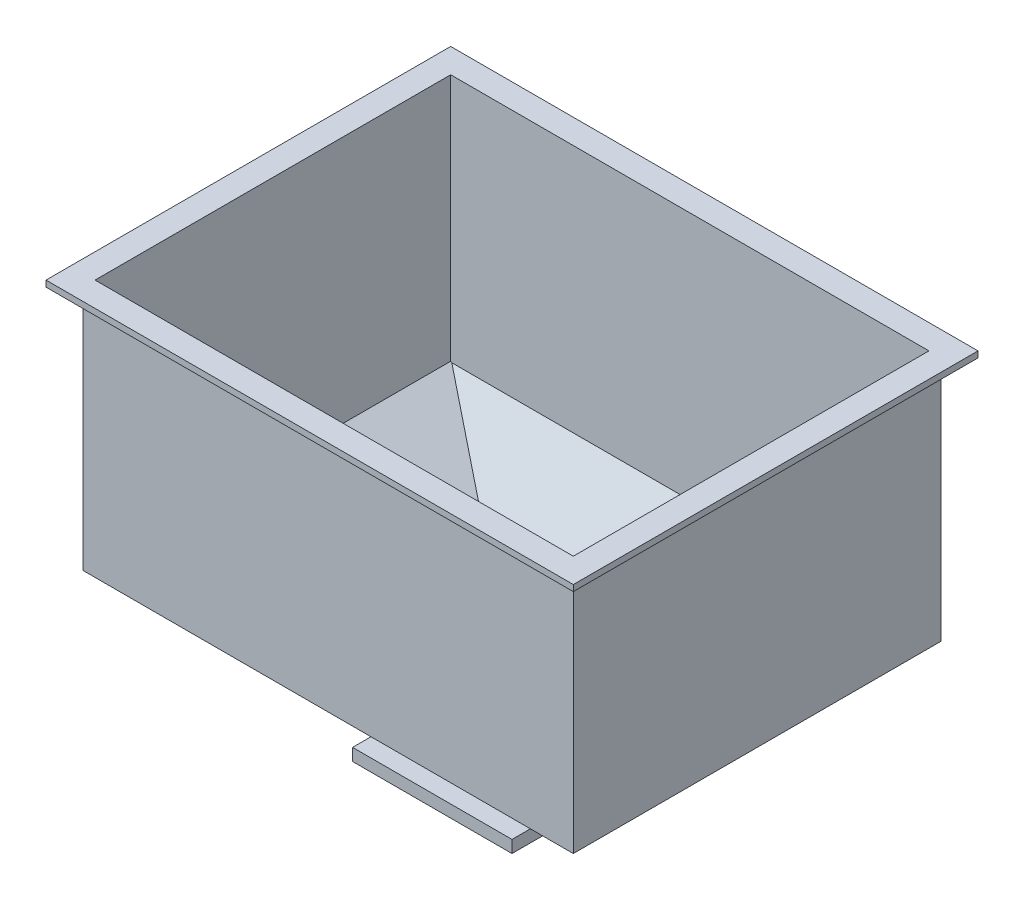
ISO-10303-21;
HEADER;
FILE_DESCRIPTION(('STEP AP214'),'2;1');
FILE_NAME('part.step','',(''),(''),'','','');
FILE_SCHEMA(('AUTOMOTIVE_DESIGN { 1 0 10303 214 1 1 1 1 }'));
ENDSEC;
DATA;
#1=APPLICATION_CONTEXT('core data for automotive mechanical design processes');
#2=APPLICATION_PROTOCOL_DEFINITION('international standard','automotive_design',2000,#1);
#3=PRODUCT_CONTEXT('',#1,'mechanical');
#4=PRODUCT('Part','Part','',(#3));
#5=PRODUCT_RELATED_PRODUCT_CATEGORY('part','',(#4));
#6=PRODUCT_DEFINITION_FORMATION('','',#4);
#7=PRODUCT_DEFINITION_CONTEXT('part definition',#1,'design');
#8=PRODUCT_DEFINITION('design','',#6,#7);
#9=PRODUCT_DEFINITION_SHAPE('','',#8);
#10=(LENGTH_UNIT() NAMED_UNIT(*) SI_UNIT(.MILLI.,.METRE.));
#11=(NAMED_UNIT(*) PLANE_ANGLE_UNIT() SI_UNIT($,.RADIAN.));
#12=(NAMED_UNIT(*) SI_UNIT($,.STERADIAN.) SOLID_ANGLE_UNIT());
#13=UNCERTAINTY_MEASURE_WITH_UNIT(LENGTH_MEASURE(1.E-05),#10,'distance_accuracy_value','');
#14=(GEOMETRIC_REPRESENTATION_CONTEXT(3) GLOBAL_UNCERTAINTY_ASSIGNED_CONTEXT((#13)) GLOBAL_UNIT_ASSIGNED_CONTEXT((#10,
#11,#12)) REPRESENTATION_CONTEXT('',''));
#15=CARTESIAN_POINT('',(0.,0.,0.));
#16=DIRECTION('',(0.,0.,1.));
#17=DIRECTION('',(1.,0.,0.));
#18=AXIS2_PLACEMENT_3D('',#15,#16,#17);
#19=CARTESIAN_POINT('',(0.,105.,0.));
#20=DIRECTION('',(0.,1.,0.));
#21=DIRECTION('',(0.,0.,1.));
#22=AXIS2_PLACEMENT_3D('',#19,#20,#21);
#23=PLANE('',#22);
#24=DIRECTION('',(0.,0.,1.));
#25=VECTOR('',#24,1.);
#26=CARTESIAN_POINT('',(-215.,105.,-315.));
#27=LINE('',#26,#25);
#28=CARTESIAN_POINT('',(-215.,105.,-315.));
#29=VERTEX_POINT('',#28);
#30=CARTESIAN_POINT('',(-215.,105.,15.));
#31=VERTEX_POINT('',#30);
#32=EDGE_CURVE('E227',#29,#31,#27,.T.);
#33=ORIENTED_EDGE('',*,*,#32,.T.);
#34=DIRECTION('',(1.,0.,0.));
#35=VECTOR('',#34,1.);
#36=CARTESIAN_POINT('',(-215.,105.,15.));
#37=LINE('',#36,#35);
#38=CARTESIAN_POINT('',(215.,105.,15.));
#39=VERTEX_POINT('',#38);
#40=EDGE_CURVE('E230',#31,#39,#37,.T.);
#41=ORIENTED_EDGE('',*,*,#40,.T.);
#42=DIRECTION('',(0.,0.,-1.));
#43=VECTOR('',#42,1.);
#44=CARTESIAN_POINT('',(215.,105.,-315.));
#45=LINE('',#44,#43);
#46=CARTESIAN_POINT('',(215.,105.,-315.));
#47=VERTEX_POINT('',#46);
#48=EDGE_CURVE('E233',#39,#47,#45,.T.);
#49=ORIENTED_EDGE('',*,*,#48,.T.);
#50=DIRECTION('',(-1.,0.,0.));
#51=VECTOR('',#50,1.);
#52=CARTESIAN_POINT('',(-215.,105.,-315.));
#53=LINE('',#52,#51);
#54=EDGE_CURVE('E235',#47,#29,#53,.T.);
#55=ORIENTED_EDGE('',*,*,#54,.T.);
#56=EDGE_LOOP('',(#33,#41,#49,#55));
#57=FACE_BOUND('',#56,.T.);
#58=DIRECTION('',(1.,0.,0.));
#59=VECTOR('',#58,1.);
#60=CARTESIAN_POINT('',(0.,105.,-295.));
#61=LINE('',#60,#59);
#62=CARTESIAN_POINT('',(-195.,105.,-295.));
#63=VERTEX_POINT('',#62);
#64=CARTESIAN_POINT('',(195.,105.,-295.));
#65=VERTEX_POINT('',#64);
#66=EDGE_CURVE('E213',#63,#65,#61,.T.);
#67=ORIENTED_EDGE('',*,*,#66,.T.);
#68=DIRECTION('',(0.,0.,1.));
#69=VECTOR('',#68,1.);
#70=CARTESIAN_POINT('',(195.,105.,0.));
#71=LINE('',#70,#69);
#72=CARTESIAN_POINT('',(195.,105.,-5.));
#73=VERTEX_POINT('',#72);
#74=EDGE_CURVE('E219',#65,#73,#71,.T.);
#75=ORIENTED_EDGE('',*,*,#74,.T.);
#76=DIRECTION('',(1.,0.,0.));
#77=VECTOR('',#76,1.);
#78=CARTESIAN_POINT('',(0.,105.,-5.));
#79=LINE('',#78,#77);
#80=CARTESIAN_POINT('',(-195.,105.,-5.));
#81=VERTEX_POINT('',#80);
#82=EDGE_CURVE('E211',#81,#73,#79,.T.);
#83=ORIENTED_EDGE('',*,*,#82,.F.);
#84=DIRECTION('',(0.,0.,1.));
#85=VECTOR('',#84,1.);
#86=CARTESIAN_POINT('',(-195.,105.,0.));
#87=LINE('',#86,#85);
#88=EDGE_CURVE('E222',#63,#81,#87,.T.);
#89=ORIENTED_EDGE('',*,*,#88,.F.);
#90=EDGE_LOOP('',(#67,#75,#83,#89));
#91=FACE_BOUND('',#90,.T.);
#92=ADVANCED_FACE('F34',(#57,#91),#23,.T.);
#93=CARTESIAN_POINT('',(200.,0.,-300.));
#94=DIRECTION('',(-1.,0.,0.));
#95=DIRECTION('',(0.,0.,1.));
#96=AXIS2_PLACEMENT_3D('',#93,#94,#95);
#97=PLANE('',#96);
#98=DIRECTION('',(0.,-1.,0.));
#99=VECTOR('',#98,1.);
#100=CARTESIAN_POINT('',(200.,0.,0.));
#101=LINE('',#100,#99);
#102=CARTESIAN_POINT('',(200.,100.,0.));
#103=VERTEX_POINT('',#102);
#104=CARTESIAN_POINT('',(200.,-100.,0.));
#105=VERTEX_POINT('',#104);
#106=EDGE_CURVE('E327',#103,#105,#101,.T.);
#107=ORIENTED_EDGE('',*,*,#106,.T.);
#108=DIRECTION('',(0.,0.,1.));
#109=VECTOR('',#108,1.);
#110=CARTESIAN_POINT('',(200.,-100.,-300.));
#111=LINE('',#110,#109);
#112=CARTESIAN_POINT('',(200.,-100.,-300.));
#113=VERTEX_POINT('',#112);
#114=EDGE_CURVE('E11',#113,#105,#111,.T.);
#115=ORIENTED_EDGE('',*,*,#114,.F.);
#116=DIRECTION('',(0.,-1.,0.));
#117=VECTOR('',#116,1.);
#118=CARTESIAN_POINT('',(200.,0.,-300.));
#119=LINE('',#118,#117);
#120=CARTESIAN_POINT('',(200.,100.,-300.));
#121=VERTEX_POINT('',#120);
#122=EDGE_CURVE('E328',#121,#113,#119,.T.);
#123=ORIENTED_EDGE('',*,*,#122,.F.);
#124=DIRECTION('',(0.,0.,1.));
#125=VECTOR('',#124,1.);
#126=CARTESIAN_POINT('',(200.,100.,-300.));
#127=LINE('',#126,#125);
#128=EDGE_CURVE('E38',#121,#103,#127,.T.);
#129=ORIENTED_EDGE('',*,*,#128,.T.);
#130=EDGE_LOOP('',(#107,#115,#123,#129));
#131=FACE_BOUND('',#130,.T.);
#132=ADVANCED_FACE('F36',(#131),#97,.F.);
#133=CARTESIAN_POINT('',(107.692307692308,-161.538461538462,-300.));
#134=DIRECTION('',(0.554700196225229,-0.832050294337844,0.));
#135=DIRECTION('',(0.832050294337844,0.554700196225229,0.));
#136=AXIS2_PLACEMENT_3D('',#133,#134,#135);
#137=PLANE('',#136);
#138=DIRECTION('',(0.727606875108999,0.485071250072666,0.485071250072666));
#139=VECTOR('',#138,1.);
#140=CARTESIAN_POINT('',(23.5294117647059,-217.647058823529,-117.647058823529));
#141=LINE('',#140,#139);
#142=CARTESIAN_POINT('',(50.,-200.,-100.));
#143=VERTEX_POINT('',#142);
#144=EDGE_CURVE('E321',#143,#105,#141,.T.);
#145=ORIENTED_EDGE('',*,*,#144,.F.);
#146=DIRECTION('',(0.,0.,1.));
#147=VECTOR('',#146,1.);
#148=CARTESIAN_POINT('',(50.,-200.,-300.));
#149=LINE('',#148,#147);
#150=CARTESIAN_POINT('',(50.,-200.,-200.));
#151=VERTEX_POINT('',#150);
#152=EDGE_CURVE('E43',#151,#143,#149,.T.);
#153=ORIENTED_EDGE('',*,*,#152,.F.);
#154=DIRECTION('',(-0.727606875108999,-0.485071250072666,0.485071250072666));
#155=VECTOR('',#154,1.);
#156=CARTESIAN_POINT('',(129.411764705882,-147.058823529412,-252.941176470588));
#157=LINE('',#156,#155);
#158=EDGE_CURVE('E325',#113,#151,#157,.T.);
#159=ORIENTED_EDGE('',*,*,#158,.F.);
#160=ORIENTED_EDGE('',*,*,#114,.T.);
#161=EDGE_LOOP('',(#145,#153,#159,#160));
#162=FACE_BOUND('',#161,.T.);
#163=ADVANCED_FACE('F387',(#162),#137,.T.);
#164=CARTESIAN_POINT('',(-107.692307692308,-161.538461538462,-300.));
#165=DIRECTION('',(-0.554700196225229,-0.832050294337844,0.));
#166=DIRECTION('',(0.832050294337844,-0.554700196225229,0.));
#167=AXIS2_PLACEMENT_3D('',#164,#165,#166);
#168=PLANE('',#167);
#169=DIRECTION('',(0.727606875108999,-0.485071250072666,-0.485071250072666));
#170=VECTOR('',#169,1.);
#171=CARTESIAN_POINT('',(-23.5294117647059,-217.647058823529,-117.647058823529));
#172=LINE('',#171,#170);
#173=CARTESIAN_POINT('',(-200.,-100.,0.));
#174=VERTEX_POINT('',#173);
#175=CARTESIAN_POINT('',(-50.,-200.,-100.));
#176=VERTEX_POINT('',#175);
#177=EDGE_CURVE('E312',#174,#176,#172,.T.);
#178=ORIENTED_EDGE('',*,*,#177,.F.);
#179=DIRECTION('',(0.,0.,1.));
#180=VECTOR('',#179,1.);
#181=CARTESIAN_POINT('',(-200.,-100.,-300.));
#182=LINE('',#181,#180);
#183=CARTESIAN_POINT('',(-200.,-100.,-300.));
#184=VERTEX_POINT('',#183);
#185=EDGE_CURVE('E349',#184,#174,#182,.T.);
#186=ORIENTED_EDGE('',*,*,#185,.F.);
#187=DIRECTION('',(-0.727606875108999,0.485071250072666,-0.485071250072666));
#188=VECTOR('',#187,1.);
#189=CARTESIAN_POINT('',(-129.411764705882,-147.058823529412,-252.941176470588));
#190=LINE('',#189,#188);
#191=CARTESIAN_POINT('',(-50.,-200.,-200.));
#192=VERTEX_POINT('',#191);
#193=EDGE_CURVE('E323',#192,#184,#190,.T.);
#194=ORIENTED_EDGE('',*,*,#193,.F.);
#195=DIRECTION('',(0.,0.,1.));
#196=VECTOR('',#195,1.);
#197=CARTESIAN_POINT('',(-50.,-200.,-300.));
#198=LINE('',#197,#196);
#199=EDGE_CURVE('E346',#192,#176,#198,.T.);
#200=ORIENTED_EDGE('',*,*,#199,.T.);
#201=EDGE_LOOP('',(#178,#186,#194,#200));
#202=FACE_BOUND('',#201,.T.);
#203=ADVANCED_FACE('F474',(#202),#168,.T.);
#204=CARTESIAN_POINT('',(-200.,0.,-300.));
#205=DIRECTION('',(-1.,0.,0.));
#206=DIRECTION('',(0.,0.,1.));
#207=AXIS2_PLACEMENT_3D('',#204,#205,#206);
#208=PLANE('',#207);
#209=DIRECTION('',(0.,-1.,0.));
#210=VECTOR('',#209,1.);
#211=CARTESIAN_POINT('',(-200.,0.,0.));
#212=LINE('',#211,#210);
#213=CARTESIAN_POINT('',(-200.,100.,0.));
#214=VERTEX_POINT('',#213);
#215=EDGE_CURVE('E332',#214,#174,#212,.T.);
#216=ORIENTED_EDGE('',*,*,#215,.F.);
#217=DIRECTION('',(0.,0.,1.));
#218=VECTOR('',#217,1.);
#219=CARTESIAN_POINT('',(-200.,100.,-300.));
#220=LINE('',#219,#218);
#221=CARTESIAN_POINT('',(-200.,100.,-300.));
#222=VERTEX_POINT('',#221);
#223=EDGE_CURVE('E351',#222,#214,#220,.T.);
#224=ORIENTED_EDGE('',*,*,#223,.F.);
#225=DIRECTION('',(0.,-1.,0.));
#226=VECTOR('',#225,1.);
#227=CARTESIAN_POINT('',(-200.,0.,-300.));
#228=LINE('',#227,#226);
#229=EDGE_CURVE('E334',#222,#184,#228,.T.);
#230=ORIENTED_EDGE('',*,*,#229,.T.);
#231=ORIENTED_EDGE('',*,*,#185,.T.);
#232=EDGE_LOOP('',(#216,#224,#230,#231));
#233=FACE_BOUND('',#232,.T.);
#234=ADVANCED_FACE('F485',(#233),#208,.T.);
#235=CARTESIAN_POINT('',(0.,0.,-300.));
#236=DIRECTION('',(0.,0.,1.));
#237=DIRECTION('',(1.,0.,0.));
#238=AXIS2_PLACEMENT_3D('',#235,#236,#237);
#239=PLANE('',#238);
#240=ORIENTED_EDGE('',*,*,#122,.T.);
#241=DIRECTION('',(1.,0.,0.));
#242=VECTOR('',#241,1.);
#243=CARTESIAN_POINT('',(-200.,-100.,-300.));
#244=LINE('',#243,#242);
#245=EDGE_CURVE('E316',#184,#113,#244,.T.);
#246=ORIENTED_EDGE('',*,*,#245,.F.);
#247=ORIENTED_EDGE('',*,*,#229,.F.);
#248=DIRECTION('',(1.,0.,0.));
#249=VECTOR('',#248,1.);
#250=CARTESIAN_POINT('',(0.,100.,-300.));
#251=LINE('',#250,#249);
#252=EDGE_CURVE('E331',#222,#121,#251,.T.);
#253=ORIENTED_EDGE('',*,*,#252,.T.);
#254=EDGE_LOOP('',(#240,#246,#247,#253));
#255=FACE_BOUND('',#254,.T.);
#256=ADVANCED_FACE('F628',(#255),#239,.F.);
#257=CARTESIAN_POINT('',(0.,0.,0.));
#258=DIRECTION('',(0.,0.,1.));
#259=DIRECTION('',(1.,0.,0.));
#260=AXIS2_PLACEMENT_3D('',#257,#258,#259);
#261=PLANE('',#260);
#262=DIRECTION('',(1.,0.,0.));
#263=VECTOR('',#262,1.);
#264=CARTESIAN_POINT('',(-200.,-100.,0.));
#265=LINE('',#264,#263);
#266=EDGE_CURVE('E309',#174,#105,#265,.T.);
#267=ORIENTED_EDGE('',*,*,#266,.T.);
#268=ORIENTED_EDGE('',*,*,#106,.F.);
#269=DIRECTION('',(1.,0.,0.));
#270=VECTOR('',#269,1.);
#271=CARTESIAN_POINT('',(0.,100.,0.));
#272=LINE('',#271,#270);
#273=EDGE_CURVE('E339',#214,#103,#272,.T.);
#274=ORIENTED_EDGE('',*,*,#273,.F.);
#275=ORIENTED_EDGE('',*,*,#215,.T.);
#276=EDGE_LOOP('',(#267,#268,#274,#275));
#277=FACE_BOUND('',#276,.T.);
#278=ADVANCED_FACE('F362',(#277),#261,.T.);
#279=CARTESIAN_POINT('',(-200.,-100.,0.));
#280=DIRECTION('',(0.,0.707106781186547,-0.707106781186547));
#281=DIRECTION('',(0.,0.707106781186548,0.707106781186548));
#282=AXIS2_PLACEMENT_3D('',#279,#280,#281);
#283=PLANE('',#282);
#284=ORIENTED_EDGE('',*,*,#144,.T.);
#285=ORIENTED_EDGE('',*,*,#266,.F.);
#286=ORIENTED_EDGE('',*,*,#177,.T.);
#287=DIRECTION('',(1.,0.,0.));
#288=VECTOR('',#287,1.);
#289=CARTESIAN_POINT('',(-200.,-200.,-100.));
#290=LINE('',#289,#288);
#291=EDGE_CURVE('E313',#176,#143,#290,.T.);
#292=ORIENTED_EDGE('',*,*,#291,.T.);
#293=EDGE_LOOP('',(#284,#285,#286,#292));
#294=FACE_BOUND('',#293,.T.);
#295=ADVANCED_FACE('F493',(#294),#283,.F.);
#296=CARTESIAN_POINT('',(-200.,-200.,-200.));
#297=DIRECTION('',(0.,0.707106781186547,0.707106781186547));
#298=DIRECTION('',(0.,-0.707106781186548,0.707106781186548));
#299=AXIS2_PLACEMENT_3D('',#296,#297,#298);
#300=PLANE('',#299);
#301=ORIENTED_EDGE('',*,*,#158,.T.);
#302=DIRECTION('',(1.,0.,0.));
#303=VECTOR('',#302,1.);
#304=CARTESIAN_POINT('',(-200.,-200.,-200.));
#305=LINE('',#304,#303);
#306=EDGE_CURVE('E304',#192,#151,#305,.T.);
#307=ORIENTED_EDGE('',*,*,#306,.F.);
#308=ORIENTED_EDGE('',*,*,#193,.T.);
#309=ORIENTED_EDGE('',*,*,#245,.T.);
#310=EDGE_LOOP('',(#301,#307,#308,#309));
#311=FACE_BOUND('',#310,.T.);
#312=ADVANCED_FACE('F498',(#311),#300,.F.);
#313=CARTESIAN_POINT('',(195.,0.,-300.));
#314=DIRECTION('',(-1.,0.,0.));
#315=DIRECTION('',(0.,0.,1.));
#316=AXIS2_PLACEMENT_3D('',#313,#314,#315);
#317=PLANE('',#316);
#318=DIRECTION('',(0.,-1.,0.));
#319=VECTOR('',#318,1.);
#320=CARTESIAN_POINT('',(195.,0.,-5.));
#321=LINE('',#320,#319);
#322=CARTESIAN_POINT('',(195.,-97.32408120756,-5.));
#323=VERTEX_POINT('',#322);
#324=EDGE_CURVE('E257',#73,#323,#321,.T.);
#325=ORIENTED_EDGE('',*,*,#324,.F.);
#326=ORIENTED_EDGE('',*,*,#74,.F.);
#327=DIRECTION('',(0.,-1.,0.));
#328=VECTOR('',#327,1.);
#329=CARTESIAN_POINT('',(195.,0.,-295.));
#330=LINE('',#329,#328);
#331=CARTESIAN_POINT('',(195.,-97.32408120756,-295.));
#332=VERTEX_POINT('',#331);
#333=EDGE_CURVE('E265',#65,#332,#330,.T.);
#334=ORIENTED_EDGE('',*,*,#333,.T.);
#335=DIRECTION('',(0.,0.,1.));
#336=VECTOR('',#335,1.);
#337=CARTESIAN_POINT('',(195.,-97.32408120756,-300.));
#338=LINE('',#337,#336);
#339=EDGE_CURVE('E261',#332,#323,#338,.T.);
#340=ORIENTED_EDGE('',*,*,#339,.T.);
#341=EDGE_LOOP('',(#325,#326,#334,#340));
#342=FACE_BOUND('',#341,.T.);
#343=ADVANCED_FACE('F510',(#342),#317,.T.);
#344=CARTESIAN_POINT('',(104.918806711182,-157.378210066772,-300.));
#345=DIRECTION('',(0.554700196225229,-0.832050294337844,0.));
#346=DIRECTION('',(0.832050294337844,0.554700196225229,0.));
#347=AXIS2_PLACEMENT_3D('',#344,#345,#346);
#348=PLANE('',#347);
#349=DIRECTION('',(0.727606875108999,0.485071250072666,0.485071250072666));
#350=VECTOR('',#349,1.);
#351=CARTESIAN_POINT('',(21.7832577271714,-212.801909389446,-119.872977201311));
#352=LINE('',#351,#350);
#353=CARTESIAN_POINT('',(40.98612181134,-200.,-107.071067811865));
#354=VERTEX_POINT('',#353);
#355=CARTESIAN_POINT('',(194.092723529138,-97.9289321881345,-5.));
#356=VERTEX_POINT('',#355);
#357=EDGE_CURVE('E269',#354,#356,#352,.T.);
#358=ORIENTED_EDGE('',*,*,#357,.T.);
#359=DIRECTION('',(-0.832050294337844,-0.554700196225229,0.));
#360=VECTOR('',#359,1.);
#361=CARTESIAN_POINT('',(104.918806711182,-157.378210066772,-5.));
#362=LINE('',#361,#360);
#363=EDGE_CURVE('E298',#323,#356,#362,.T.);
#364=ORIENTED_EDGE('',*,*,#363,.F.);
#365=ORIENTED_EDGE('',*,*,#339,.F.);
#366=DIRECTION('',(-0.832050294337844,-0.554700196225229,0.));
#367=VECTOR('',#366,1.);
#368=CARTESIAN_POINT('',(104.918806711182,-157.378210066772,-295.));
#369=LINE('',#368,#367);
#370=CARTESIAN_POINT('',(194.092723529138,-97.9289321881346,-295.));
#371=VERTEX_POINT('',#370);
#372=EDGE_CURVE('E264',#332,#371,#369,.T.);
#373=ORIENTED_EDGE('',*,*,#372,.T.);
#374=DIRECTION('',(-0.727606875108999,-0.485071250072666,0.485071250072666));
#375=VECTOR('',#374,1.);
#376=CARTESIAN_POINT('',(127.665610668348,-142.213674095328,-250.715258092806));
#377=LINE('',#376,#375);
#378=CARTESIAN_POINT('',(40.98612181134,-200.,-192.928932188135));
#379=VERTEX_POINT('',#378);
#380=EDGE_CURVE('E260',#371,#379,#377,.T.);
#381=ORIENTED_EDGE('',*,*,#380,.T.);
#382=DIRECTION('',(0.,0.,1.));
#383=VECTOR('',#382,1.);
#384=CARTESIAN_POINT('',(40.98612181134,-200.,-300.));
#385=LINE('',#384,#383);
#386=EDGE_CURVE('E59',#379,#354,#385,.T.);
#387=ORIENTED_EDGE('',*,*,#386,.T.);
#388=EDGE_LOOP('',(#358,#364,#365,#373,#381,#387));
#389=FACE_BOUND('',#388,.T.);
#390=ADVANCED_FACE('F518',(#389),#348,.F.);
#391=CARTESIAN_POINT('',(-104.918806711182,-157.378210066772,-300.));
#392=DIRECTION('',(-0.554700196225229,-0.832050294337844,0.));
#393=DIRECTION('',(0.832050294337844,-0.554700196225229,0.));
#394=AXIS2_PLACEMENT_3D('',#391,#392,#393);
#395=PLANE('',#394);
#396=DIRECTION('',(0.727606875108999,-0.485071250072666,-0.485071250072666));
#397=VECTOR('',#396,1.);
#398=CARTESIAN_POINT('',(-21.7832577271714,-212.801909389446,-119.872977201311));
#399=LINE('',#398,#397);
#400=CARTESIAN_POINT('',(-194.092723529138,-97.9289321881345,-5.));
#401=VERTEX_POINT('',#400);
#402=CARTESIAN_POINT('',(-40.98612181134,-200.,-107.071067811865));
#403=VERTEX_POINT('',#402);
#404=EDGE_CURVE('E273',#401,#403,#399,.T.);
#405=ORIENTED_EDGE('',*,*,#404,.T.);
#406=DIRECTION('',(0.,0.,1.));
#407=VECTOR('',#406,1.);
#408=CARTESIAN_POINT('',(-40.98612181134,-200.,-300.));
#409=LINE('',#408,#407);
#410=CARTESIAN_POINT('',(-40.98612181134,-200.,-192.928932188135));
#411=VERTEX_POINT('',#410);
#412=EDGE_CURVE('E288',#411,#403,#409,.T.);
#413=ORIENTED_EDGE('',*,*,#412,.F.);
#414=DIRECTION('',(-0.727606875108999,0.485071250072666,-0.485071250072666));
#415=VECTOR('',#414,1.);
#416=CARTESIAN_POINT('',(-127.665610668348,-142.213674095328,-250.715258092806));
#417=LINE('',#416,#415);
#418=CARTESIAN_POINT('',(-194.092723529138,-97.9289321881346,-295.));
#419=VERTEX_POINT('',#418);
#420=EDGE_CURVE('E272',#411,#419,#417,.T.);
#421=ORIENTED_EDGE('',*,*,#420,.T.);
#422=DIRECTION('',(0.832050294337844,-0.554700196225229,0.));
#423=VECTOR('',#422,1.);
#424=CARTESIAN_POINT('',(-104.918806711182,-157.378210066772,-295.));
#425=LINE('',#424,#423);
#426=CARTESIAN_POINT('',(-195.,-97.32408120756,-295.));
#427=VERTEX_POINT('',#426);
#428=EDGE_CURVE('E295',#427,#419,#425,.T.);
#429=ORIENTED_EDGE('',*,*,#428,.F.);
#430=DIRECTION('',(0.,0.,1.));
#431=VECTOR('',#430,1.);
#432=CARTESIAN_POINT('',(-195.,-97.32408120756,-300.));
#433=LINE('',#432,#431);
#434=CARTESIAN_POINT('',(-195.,-97.32408120756,-5.));
#435=VERTEX_POINT('',#434);
#436=EDGE_CURVE('E282',#427,#435,#433,.T.);
#437=ORIENTED_EDGE('',*,*,#436,.T.);
#438=DIRECTION('',(0.832050294337844,-0.554700196225229,0.));
#439=VECTOR('',#438,1.);
#440=CARTESIAN_POINT('',(-104.918806711182,-157.378210066772,-5.));
#441=LINE('',#440,#439);
#442=EDGE_CURVE('E301',#435,#401,#441,.T.);
#443=ORIENTED_EDGE('',*,*,#442,.T.);
#444=EDGE_LOOP('',(#405,#413,#421,#429,#437,#443));
#445=FACE_BOUND('',#444,.T.);
#446=ADVANCED_FACE('F522',(#445),#395,.F.);
#447=CARTESIAN_POINT('',(-195.,0.,-300.));
#448=DIRECTION('',(-1.,0.,0.));
#449=DIRECTION('',(0.,0.,1.));
#450=AXIS2_PLACEMENT_3D('',#447,#448,#449);
#451=PLANE('',#450);
#452=DIRECTION('',(0.,-1.,0.));
#453=VECTOR('',#452,1.);
#454=CARTESIAN_POINT('',(-195.,0.,-5.));
#455=LINE('',#454,#453);
#456=EDGE_CURVE('E51',#81,#435,#455,.T.);
#457=ORIENTED_EDGE('',*,*,#456,.T.);
#458=ORIENTED_EDGE('',*,*,#436,.F.);
#459=DIRECTION('',(0.,-1.,0.));
#460=VECTOR('',#459,1.);
#461=CARTESIAN_POINT('',(-195.,0.,-295.));
#462=LINE('',#461,#460);
#463=EDGE_CURVE('E268',#63,#427,#462,.T.);
#464=ORIENTED_EDGE('',*,*,#463,.F.);
#465=ORIENTED_EDGE('',*,*,#88,.T.);
#466=EDGE_LOOP('',(#457,#458,#464,#465));
#467=FACE_BOUND('',#466,.T.);
#468=ADVANCED_FACE('F532',(#467),#451,.F.);
#469=CARTESIAN_POINT('',(0.,0.,-295.));
#470=DIRECTION('',(0.,0.,1.));
#471=DIRECTION('',(1.,0.,0.));
#472=AXIS2_PLACEMENT_3D('',#469,#470,#471);
#473=PLANE('',#472);
#474=ORIENTED_EDGE('',*,*,#333,.F.);
#475=ORIENTED_EDGE('',*,*,#66,.F.);
#476=ORIENTED_EDGE('',*,*,#463,.T.);
#477=ORIENTED_EDGE('',*,*,#428,.T.);
#478=DIRECTION('',(1.,0.,0.));
#479=VECTOR('',#478,1.);
#480=CARTESIAN_POINT('',(-200.,-97.9289321881346,-295.));
#481=LINE('',#480,#479);
#482=EDGE_CURVE('E276',#419,#371,#481,.T.);
#483=ORIENTED_EDGE('',*,*,#482,.T.);
#484=ORIENTED_EDGE('',*,*,#372,.F.);
#485=EDGE_LOOP('',(#474,#475,#476,#477,#483,#484));
#486=FACE_BOUND('',#485,.T.);
#487=ADVANCED_FACE('F456',(#486),#473,.T.);
#488=CARTESIAN_POINT('',(0.,0.,-5.));
#489=DIRECTION('',(0.,0.,1.));
#490=DIRECTION('',(1.,0.,0.));
#491=AXIS2_PLACEMENT_3D('',#488,#489,#490);
#492=PLANE('',#491);
#493=DIRECTION('',(1.,0.,0.));
#494=VECTOR('',#493,1.);
#495=CARTESIAN_POINT('',(-200.,-97.9289321881345,-5.));
#496=LINE('',#495,#494);
#497=EDGE_CURVE('E285',#401,#356,#496,.T.);
#498=ORIENTED_EDGE('',*,*,#497,.F.);
#499=ORIENTED_EDGE('',*,*,#442,.F.);
#500=ORIENTED_EDGE('',*,*,#456,.F.);
#501=ORIENTED_EDGE('',*,*,#82,.T.);
#502=ORIENTED_EDGE('',*,*,#324,.T.);
#503=ORIENTED_EDGE('',*,*,#363,.T.);
#504=EDGE_LOOP('',(#498,#499,#500,#501,#502,#503));
#505=FACE_BOUND('',#504,.T.);
#506=ADVANCED_FACE('F450',(#505),#492,.F.);
#507=CARTESIAN_POINT('',(-200.,-96.4644660940673,-3.53553390593274));
#508=DIRECTION('',(0.,0.707106781186547,-0.707106781186547));
#509=DIRECTION('',(0.,0.707106781186548,0.707106781186548));
#510=AXIS2_PLACEMENT_3D('',#507,#508,#509);
#511=PLANE('',#510);
#512=ORIENTED_EDGE('',*,*,#357,.F.);
#513=DIRECTION('',(1.,0.,0.));
#514=VECTOR('',#513,1.);
#515=CARTESIAN_POINT('',(0.,-200.,-107.071067811865));
#516=LINE('',#515,#514);
#517=EDGE_CURVE('E279',#403,#354,#516,.T.);
#518=ORIENTED_EDGE('',*,*,#517,.F.);
#519=ORIENTED_EDGE('',*,*,#404,.F.);
#520=ORIENTED_EDGE('',*,*,#497,.T.);
#521=EDGE_LOOP('',(#512,#518,#519,#520));
#522=FACE_BOUND('',#521,.T.);
#523=ADVANCED_FACE('F376',(#522),#511,.T.);
#524=CARTESIAN_POINT('',(-200.,-196.464466094067,-196.464466094067));
#525=DIRECTION('',(0.,0.707106781186547,0.707106781186547));
#526=DIRECTION('',(0.,-0.707106781186548,0.707106781186548));
#527=AXIS2_PLACEMENT_3D('',#524,#525,#526);
#528=PLANE('',#527);
#529=ORIENTED_EDGE('',*,*,#380,.F.);
#530=ORIENTED_EDGE('',*,*,#482,.F.);
#531=ORIENTED_EDGE('',*,*,#420,.F.);
#532=DIRECTION('',(1.,0.,0.));
#533=VECTOR('',#532,1.);
#534=CARTESIAN_POINT('',(-200.,-200.,-192.928932188135));
#535=LINE('',#534,#533);
#536=EDGE_CURVE('E256',#411,#379,#535,.T.);
#537=ORIENTED_EDGE('',*,*,#536,.T.);
#538=EDGE_LOOP('',(#529,#530,#531,#537));
#539=FACE_BOUND('',#538,.T.);
#540=ADVANCED_FACE('F366',(#539),#528,.T.);
#541=CARTESIAN_POINT('',(0.,100.,0.));
#542=DIRECTION('',(0.,1.,0.));
#543=DIRECTION('',(0.,0.,1.));
#544=AXIS2_PLACEMENT_3D('',#541,#542,#543);
#545=PLANE('',#544);
#546=DIRECTION('',(0.,0.,1.));
#547=VECTOR('',#546,1.);
#548=CARTESIAN_POINT('',(-215.,100.,-315.));
#549=LINE('',#548,#547);
#550=CARTESIAN_POINT('',(-215.,100.,-315.));
#551=VERTEX_POINT('',#550);
#552=CARTESIAN_POINT('',(-215.,100.,15.));
#553=VERTEX_POINT('',#552);
#554=EDGE_CURVE('E225',#551,#553,#549,.T.);
#555=ORIENTED_EDGE('',*,*,#554,.F.);
#556=DIRECTION('',(-1.,0.,0.));
#557=VECTOR('',#556,1.);
#558=CARTESIAN_POINT('',(-215.,100.,-315.));
#559=LINE('',#558,#557);
#560=CARTESIAN_POINT('',(215.,100.,-315.));
#561=VERTEX_POINT('',#560);
#562=EDGE_CURVE('E231',#561,#551,#559,.T.);
#563=ORIENTED_EDGE('',*,*,#562,.F.);
#564=DIRECTION('',(0.,0.,-1.));
#565=VECTOR('',#564,1.);
#566=CARTESIAN_POINT('',(215.,100.,-315.));
#567=LINE('',#566,#565);
#568=CARTESIAN_POINT('',(215.,100.,15.));
#569=VERTEX_POINT('',#568);
#570=EDGE_CURVE('E242',#569,#561,#567,.T.);
#571=ORIENTED_EDGE('',*,*,#570,.F.);
#572=DIRECTION('',(1.,0.,0.));
#573=VECTOR('',#572,1.);
#574=CARTESIAN_POINT('',(-215.,100.,15.));
#575=LINE('',#574,#573);
#576=EDGE_CURVE('E240',#553,#569,#575,.T.);
#577=ORIENTED_EDGE('',*,*,#576,.F.);
#578=EDGE_LOOP('',(#555,#563,#571,#577));
#579=FACE_BOUND('',#578,.T.);
#580=ORIENTED_EDGE('',*,*,#223,.T.);
#581=ORIENTED_EDGE('',*,*,#273,.T.);
#582=ORIENTED_EDGE('',*,*,#128,.F.);
#583=ORIENTED_EDGE('',*,*,#252,.F.);
#584=EDGE_LOOP('',(#580,#581,#582,#583));
#585=FACE_BOUND('',#584,.T.);
#586=ADVANCED_FACE('F363',(#579,#585),#545,.F.);
#587=CARTESIAN_POINT('',(-215.,105.,-315.));
#588=DIRECTION('',(1.,0.,0.));
#589=DIRECTION('',(0.,0.,-1.));
#590=AXIS2_PLACEMENT_3D('',#587,#588,#589);
#591=PLANE('',#590);
#592=ORIENTED_EDGE('',*,*,#554,.T.);
#593=DIRECTION('',(0.,-1.,0.));
#594=VECTOR('',#593,1.);
#595=CARTESIAN_POINT('',(-215.,105.,15.));
#596=LINE('',#595,#594);
#597=EDGE_CURVE('E253',#31,#553,#596,.T.);
#598=ORIENTED_EDGE('',*,*,#597,.F.);
#599=ORIENTED_EDGE('',*,*,#32,.F.);
#600=DIRECTION('',(0.,-1.,0.));
#601=VECTOR('',#600,1.);
#602=CARTESIAN_POINT('',(-215.,105.,-315.));
#603=LINE('',#602,#601);
#604=EDGE_CURVE('E237',#29,#551,#603,.T.);
#605=ORIENTED_EDGE('',*,*,#604,.T.);
#606=EDGE_LOOP('',(#592,#598,#599,#605));
#607=FACE_BOUND('',#606,.T.);
#608=ADVANCED_FACE('F365',(#607),#591,.F.);
#609=CARTESIAN_POINT('',(-215.,105.,15.));
#610=DIRECTION('',(0.,0.,-1.));
#611=DIRECTION('',(-1.,0.,0.));
#612=AXIS2_PLACEMENT_3D('',#609,#610,#611);
#613=PLANE('',#612);
#614=ORIENTED_EDGE('',*,*,#576,.T.);
#615=DIRECTION('',(0.,-1.,0.));
#616=VECTOR('',#615,1.);
#617=CARTESIAN_POINT('',(215.,105.,15.));
#618=LINE('',#617,#616);
#619=EDGE_CURVE('E250',#39,#569,#618,.T.);
#620=ORIENTED_EDGE('',*,*,#619,.F.);
#621=ORIENTED_EDGE('',*,*,#40,.F.);
#622=ORIENTED_EDGE('',*,*,#597,.T.);
#623=EDGE_LOOP('',(#614,#620,#621,#622));
#624=FACE_BOUND('',#623,.T.);
#625=ADVANCED_FACE('F373',(#624),#613,.F.);
#626=CARTESIAN_POINT('',(215.,105.,-315.));
#627=DIRECTION('',(-1.,0.,0.));
#628=DIRECTION('',(0.,0.,1.));
#629=AXIS2_PLACEMENT_3D('',#626,#627,#628);
#630=PLANE('',#629);
#631=ORIENTED_EDGE('',*,*,#570,.T.);
#632=DIRECTION('',(0.,-1.,0.));
#633=VECTOR('',#632,1.);
#634=CARTESIAN_POINT('',(215.,105.,-315.));
#635=LINE('',#634,#633);
#636=EDGE_CURVE('E247',#47,#561,#635,.T.);
#637=ORIENTED_EDGE('',*,*,#636,.F.);
#638=ORIENTED_EDGE('',*,*,#48,.F.);
#639=ORIENTED_EDGE('',*,*,#619,.T.);
#640=EDGE_LOOP('',(#631,#637,#638,#639));
#641=FACE_BOUND('',#640,.T.);
#642=ADVANCED_FACE('F567',(#641),#630,.F.);
#643=CARTESIAN_POINT('',(-215.,105.,-315.));
#644=DIRECTION('',(0.,0.,1.));
#645=DIRECTION('',(1.,0.,0.));
#646=AXIS2_PLACEMENT_3D('',#643,#644,#645);
#647=PLANE('',#646);
#648=ORIENTED_EDGE('',*,*,#562,.T.);
#649=ORIENTED_EDGE('',*,*,#604,.F.);
#650=ORIENTED_EDGE('',*,*,#54,.F.);
#651=ORIENTED_EDGE('',*,*,#636,.T.);
#652=EDGE_LOOP('',(#648,#649,#650,#651));
#653=FACE_BOUND('',#652,.T.);
#654=ADVANCED_FACE('F447',(#653),#647,.F.);
#655=CARTESIAN_POINT('',(0.,-200.,0.));
#656=DIRECTION('',(0.,-1.,0.));
#657=DIRECTION('',(0.,0.,-1.));
#658=AXIS2_PLACEMENT_3D('',#655,#656,#657);
#659=PLANE('',#658);
#660=ORIENTED_EDGE('',*,*,#536,.F.);
#661=ORIENTED_EDGE('',*,*,#412,.T.);
#662=ORIENTED_EDGE('',*,*,#517,.T.);
#663=ORIENTED_EDGE('',*,*,#386,.F.);
#664=EDGE_LOOP('',(#660,#661,#662,#663));
#665=FACE_BOUND('',#664,.T.);
#666=ADVANCED_FACE('F392',(#665),#659,.F.);
#667=CARTESIAN_POINT('',(65.,-210.,-215.));
#668=DIRECTION('',(-1.,0.,0.));
#669=DIRECTION('',(0.,0.,1.));
#670=AXIS2_PLACEMENT_3D('',#667,#668,#669);
#671=PLANE('',#670);
#672=DIRECTION('',(0.,0.,1.));
#673=VECTOR('',#672,1.);
#674=CARTESIAN_POINT('',(65.,-200.,-215.));
#675=LINE('',#674,#673);
#676=CARTESIAN_POINT('',(65.,-200.,-215.));
#677=VERTEX_POINT('',#676);
#678=CARTESIAN_POINT('',(65.,-200.,-85.));
#679=VERTEX_POINT('',#678);
#680=EDGE_CURVE('E210',#677,#679,#675,.T.);
#681=ORIENTED_EDGE('',*,*,#680,.T.);
#682=DIRECTION('',(0.,1.,0.));
#683=VECTOR('',#682,1.);
#684=CARTESIAN_POINT('',(65.,-210.,-85.));
#685=LINE('',#684,#683);
#686=CARTESIAN_POINT('',(65.,-210.,-85.));
#687=VERTEX_POINT('',#686);
#688=EDGE_CURVE('E190',#687,#679,#685,.T.);
#689=ORIENTED_EDGE('',*,*,#688,.F.);
#690=DIRECTION('',(0.,0.,1.));
#691=VECTOR('',#690,1.);
#692=CARTESIAN_POINT('',(65.,-210.,-215.));
#693=LINE('',#692,#691);
#694=CARTESIAN_POINT('',(65.,-210.,-215.));
#695=VERTEX_POINT('',#694);
#696=EDGE_CURVE('E197',#695,#687,#693,.T.);
#697=ORIENTED_EDGE('',*,*,#696,.F.);
#698=DIRECTION('',(0.,1.,0.));
#699=VECTOR('',#698,1.);
#700=CARTESIAN_POINT('',(65.,-210.,-215.));
#701=LINE('',#700,#699);
#702=EDGE_CURVE('E656',#695,#677,#701,.T.);
#703=ORIENTED_EDGE('',*,*,#702,.T.);
#704=EDGE_LOOP('',(#681,#689,#697,#703));
#705=FACE_BOUND('',#704,.T.);
#706=ADVANCED_FACE('F208',(#705),#671,.F.);
#707=CARTESIAN_POINT('',(65.,-210.,-85.));
#708=DIRECTION('',(0.,0.,-1.));
#709=DIRECTION('',(-1.,0.,0.));
#710=AXIS2_PLACEMENT_3D('',#707,#708,#709);
#711=PLANE('',#710);
#712=DIRECTION('',(-1.,0.,0.));
#713=VECTOR('',#712,1.);
#714=CARTESIAN_POINT('',(65.,-200.,-85.));
#715=LINE('',#714,#713);
#716=CARTESIAN_POINT('',(-65.,-200.,-85.));
#717=VERTEX_POINT('',#716);
#718=EDGE_CURVE('E647',#679,#717,#715,.T.);
#719=ORIENTED_EDGE('',*,*,#718,.T.);
#720=DIRECTION('',(0.,1.,0.));
#721=VECTOR('',#720,1.);
#722=CARTESIAN_POINT('',(-65.,-210.,-85.));
#723=LINE('',#722,#721);
#724=CARTESIAN_POINT('',(-65.,-210.,-85.));
#725=VERTEX_POINT('',#724);
#726=EDGE_CURVE('E193',#725,#717,#723,.T.);
#727=ORIENTED_EDGE('',*,*,#726,.F.);
#728=DIRECTION('',(-1.,0.,0.));
#729=VECTOR('',#728,1.);
#730=CARTESIAN_POINT('',(65.,-210.,-85.));
#731=LINE('',#730,#729);
#732=EDGE_CURVE('E186',#687,#725,#731,.T.);
#733=ORIENTED_EDGE('',*,*,#732,.F.);
#734=ORIENTED_EDGE('',*,*,#688,.T.);
#735=EDGE_LOOP('',(#719,#727,#733,#734));
#736=FACE_BOUND('',#735,.T.);
#737=ADVANCED_FACE('F188',(#736),#711,.F.);
#738=CARTESIAN_POINT('',(-65.,-210.,-215.));
#739=DIRECTION('',(1.,0.,0.));
#740=DIRECTION('',(0.,0.,-1.));
#741=AXIS2_PLACEMENT_3D('',#738,#739,#740);
#742=PLANE('',#741);
#743=DIRECTION('',(0.,0.,-1.));
#744=VECTOR('',#743,1.);
#745=CARTESIAN_POINT('',(-65.,-200.,-215.));
#746=LINE('',#745,#744);
#747=CARTESIAN_POINT('',(-65.,-200.,-215.));
#748=VERTEX_POINT('',#747);
#749=EDGE_CURVE('E649',#717,#748,#746,.T.);
#750=ORIENTED_EDGE('',*,*,#749,.T.);
#751=DIRECTION('',(0.,1.,0.));
#752=VECTOR('',#751,1.);
#753=CARTESIAN_POINT('',(-65.,-210.,-215.));
#754=LINE('',#753,#752);
#755=CARTESIAN_POINT('',(-65.,-210.,-215.));
#756=VERTEX_POINT('',#755);
#757=EDGE_CURVE('E215',#756,#748,#754,.T.);
#758=ORIENTED_EDGE('',*,*,#757,.F.);
#759=DIRECTION('',(0.,0.,-1.));
#760=VECTOR('',#759,1.);
#761=CARTESIAN_POINT('',(-65.,-210.,-215.));
#762=LINE('',#761,#760);
#763=EDGE_CURVE('E196',#725,#756,#762,.T.);
#764=ORIENTED_EDGE('',*,*,#763,.F.);
#765=ORIENTED_EDGE('',*,*,#726,.T.);
#766=EDGE_LOOP('',(#750,#758,#764,#765));
#767=FACE_BOUND('',#766,.T.);
#768=ADVANCED_FACE('F395',(#767),#742,.F.);
#769=CARTESIAN_POINT('',(65.,-210.,-215.));
#770=DIRECTION('',(0.,0.,1.));
#771=DIRECTION('',(1.,0.,0.));
#772=AXIS2_PLACEMENT_3D('',#769,#770,#771);
#773=PLANE('',#772);
#774=DIRECTION('',(1.,0.,0.));
#775=VECTOR('',#774,1.);
#776=CARTESIAN_POINT('',(65.,-200.,-215.));
#777=LINE('',#776,#775);
#778=EDGE_CURVE('E206',#748,#677,#777,.T.);
#779=ORIENTED_EDGE('',*,*,#778,.T.);
#780=ORIENTED_EDGE('',*,*,#702,.F.);
#781=DIRECTION('',(1.,0.,0.));
#782=VECTOR('',#781,1.);
#783=CARTESIAN_POINT('',(65.,-210.,-215.));
#784=LINE('',#783,#782);
#785=EDGE_CURVE('E202',#756,#695,#784,.T.);
#786=ORIENTED_EDGE('',*,*,#785,.F.);
#787=ORIENTED_EDGE('',*,*,#757,.T.);
#788=EDGE_LOOP('',(#779,#780,#786,#787));
#789=FACE_BOUND('',#788,.T.);
#790=ADVANCED_FACE('F398',(#789),#773,.F.);
#791=CARTESIAN_POINT('',(0.,-210.,0.));
#792=DIRECTION('',(0.,-1.,0.));
#793=DIRECTION('',(0.,0.,-1.));
#794=AXIS2_PLACEMENT_3D('',#791,#792,#793);
#795=PLANE('',#794);
#796=ORIENTED_EDGE('',*,*,#696,.T.);
#797=ORIENTED_EDGE('',*,*,#732,.T.);
#798=ORIENTED_EDGE('',*,*,#763,.T.);
#799=ORIENTED_EDGE('',*,*,#785,.T.);
#800=EDGE_LOOP('',(#796,#797,#798,#799));
#801=FACE_BOUND('',#800,.T.);
#802=ADVANCED_FACE('F200',(#801),#795,.T.);
#803=ORIENTED_EDGE('',*,*,#291,.F.);
#804=ORIENTED_EDGE('',*,*,#199,.F.);
#805=ORIENTED_EDGE('',*,*,#306,.T.);
#806=ORIENTED_EDGE('',*,*,#152,.T.);
#807=EDGE_LOOP('',(#803,#804,#805,#806));
#808=FACE_BOUND('',#807,.T.);
#809=ORIENTED_EDGE('',*,*,#680,.F.);
#810=ORIENTED_EDGE('',*,*,#778,.F.);
#811=ORIENTED_EDGE('',*,*,#749,.F.);
#812=ORIENTED_EDGE('',*,*,#718,.F.);
#813=EDGE_LOOP('',(#809,#810,#811,#812));
#814=FACE_BOUND('',#813,.T.);
#815=ADVANCED_FACE('F403',(#808,#814),#659,.F.);
#816=CLOSED_SHELL('',(#92,#132,#163,#203,#234,#256,#278,#295,#312,#343,#390,#446,#468,#487,#506,
#523,#540,#586,#608,#625,#642,#654,#666,#706,#737,#768,#790,#802,#815));
#817=MANIFOLD_SOLID_BREP('B2',#816);
#818=ADVANCED_BREP_SHAPE_REPRESENTATION('',(#18,#817),#14);
#819=SHAPE_DEFINITION_REPRESENTATION(#9,#818);
ENDSEC;
END-ISO-10303-21;
